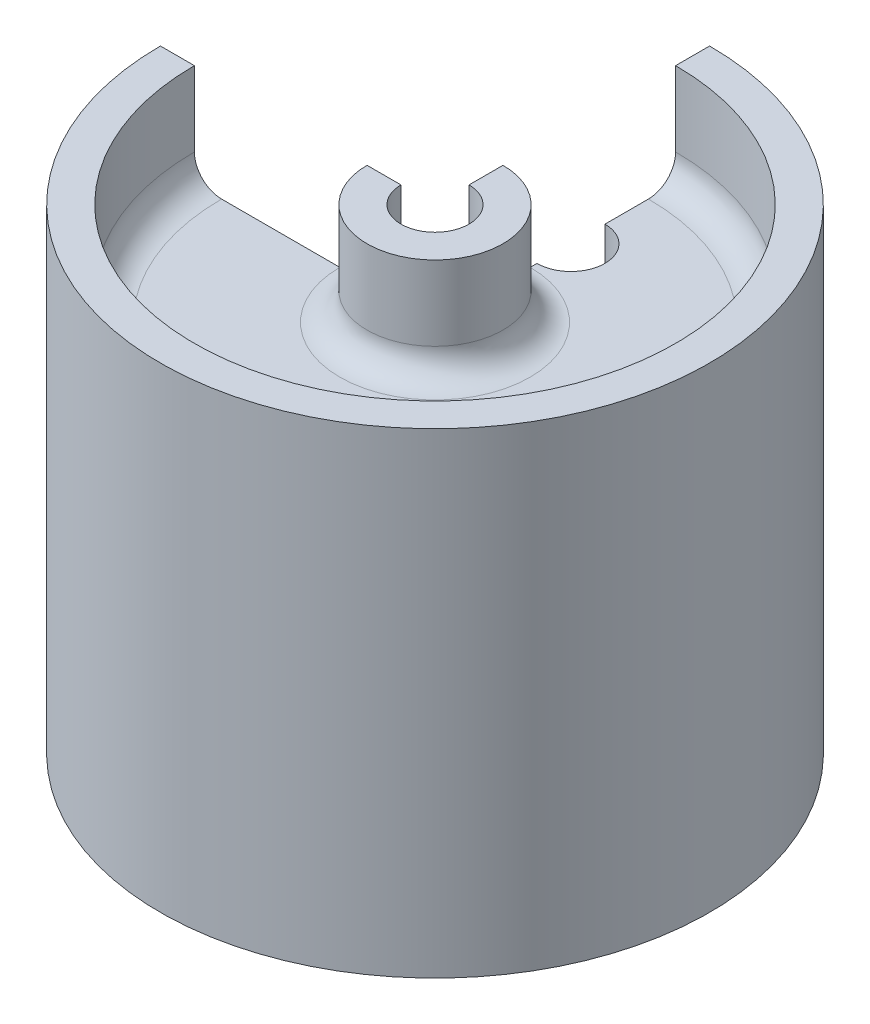
ISO-10303-21;
HEADER;
FILE_DESCRIPTION(('STEP AP214'),'2;1');
FILE_NAME('part.step','',(''),(''),'','','');
FILE_SCHEMA(('AUTOMOTIVE_DESIGN { 1 0 10303 214 1 1 1 1 }'));
ENDSEC;
DATA;
#1=APPLICATION_CONTEXT('core data for automotive mechanical design processes');
#2=APPLICATION_PROTOCOL_DEFINITION('international standard','automotive_design',2000,#1);
#3=PRODUCT_CONTEXT('',#1,'mechanical');
#4=PRODUCT('Part','Part','',(#3));
#5=PRODUCT_RELATED_PRODUCT_CATEGORY('part','',(#4));
#6=PRODUCT_DEFINITION_FORMATION('','',#4);
#7=PRODUCT_DEFINITION_CONTEXT('part definition',#1,'design');
#8=PRODUCT_DEFINITION('design','',#6,#7);
#9=PRODUCT_DEFINITION_SHAPE('','',#8);
#10=(LENGTH_UNIT() NAMED_UNIT(*) SI_UNIT(.MILLI.,.METRE.));
#11=(NAMED_UNIT(*) PLANE_ANGLE_UNIT() SI_UNIT($,.RADIAN.));
#12=(NAMED_UNIT(*) SI_UNIT($,.STERADIAN.) SOLID_ANGLE_UNIT());
#13=UNCERTAINTY_MEASURE_WITH_UNIT(LENGTH_MEASURE(1.E-05),#10,'distance_accuracy_value','');
#14=(GEOMETRIC_REPRESENTATION_CONTEXT(3) GLOBAL_UNCERTAINTY_ASSIGNED_CONTEXT((#13)) GLOBAL_UNIT_ASSIGNED_CONTEXT((#10,
#11,#12)) REPRESENTATION_CONTEXT('',''));
#15=CARTESIAN_POINT('',(0.,0.,0.));
#16=DIRECTION('',(0.,0.,1.));
#17=DIRECTION('',(1.,0.,0.));
#18=AXIS2_PLACEMENT_3D('',#15,#16,#17);
#19=CARTESIAN_POINT('',(0.,0.,0.));
#20=DIRECTION('',(1.,0.,0.));
#21=DIRECTION('',(0.,0.,-1.));
#22=AXIS2_PLACEMENT_3D('',#19,#20,#21);
#23=PLANE('',#22);
#24=DIRECTION('',(0.,-1.,0.));
#25=VECTOR('',#24,1.);
#26=CARTESIAN_POINT('',(0.,45.0234349741081,-9.525));
#27=LINE('',#26,#25);
#28=CARTESIAN_POINT('',(0.,32.3234349741081,-9.525));
#29=VERTEX_POINT('',#28);
#30=CARTESIAN_POINT('',(0.,35.4984349741081,-9.525));
#31=VERTEX_POINT('',#30);
#32=EDGE_CURVE('E175',#29,#31,#27,.F.);
#33=ORIENTED_EDGE('',*,*,#32,.F.);
#34=DIRECTION('',(0.,0.,-1.));
#35=VECTOR('',#34,1.);
#36=CARTESIAN_POINT('',(0.,32.3234349741081,-22.479));
#37=LINE('',#36,#35);
#38=CARTESIAN_POINT('',(0.,32.3234349741081,-8.89));
#39=VERTEX_POINT('',#38);
#40=EDGE_CURVE('E186',#39,#29,#37,.T.);
#41=ORIENTED_EDGE('',*,*,#40,.F.);
#42=CARTESIAN_POINT('',(0.,29.7834349741081,-8.89));
#43=DIRECTION('',(1.,0.,0.));
#44=DIRECTION('',(0.,0.,-1.));
#45=AXIS2_PLACEMENT_3D('',#42,#43,#44);
#46=CIRCLE('',#45,2.54);
#47=CARTESIAN_POINT('',(0.,29.7834349741081,-6.35));
#48=VERTEX_POINT('',#47);
#49=EDGE_CURVE('E314',#39,#48,#46,.T.);
#50=ORIENTED_EDGE('',*,*,#49,.T.);
#51=DIRECTION('',(0.,1.,0.));
#52=VECTOR('',#51,1.);
#53=CARTESIAN_POINT('',(0.,32.3234349741081,-6.35));
#54=LINE('',#53,#52);
#55=CARTESIAN_POINT('',(0.,0.57343497410807,-6.35));
#56=VERTEX_POINT('',#55);
#57=EDGE_CURVE('E194',#56,#48,#54,.T.);
#58=ORIENTED_EDGE('',*,*,#57,.F.);
#59=DIRECTION('',(0.,0.,-1.));
#60=VECTOR('',#59,1.);
#61=CARTESIAN_POINT('',(0.,0.57343497410807,-3.17500000000001));
#62=LINE('',#61,#60);
#63=CARTESIAN_POINT('',(0.,0.57343497410807,-3.17500000000001));
#64=VERTEX_POINT('',#63);
#65=EDGE_CURVE('E200',#64,#56,#62,.T.);
#66=ORIENTED_EDGE('',*,*,#65,.F.);
#67=DIRECTION('',(0.,-1.,0.));
#68=VECTOR('',#67,1.);
#69=CARTESIAN_POINT('',(0.,45.0234349741081,-3.175));
#70=LINE('',#69,#68);
#71=CARTESIAN_POINT('',(0.,45.0234349741081,-3.175));
#72=VERTEX_POINT('',#71);
#73=EDGE_CURVE('E366',#72,#64,#70,.T.);
#74=ORIENTED_EDGE('',*,*,#73,.F.);
#75=DIRECTION('',(0.,0.,1.));
#76=VECTOR('',#75,1.);
#77=CARTESIAN_POINT('',(0.,45.0234349741081,-6.35));
#78=LINE('',#77,#76);
#79=CARTESIAN_POINT('',(0.,45.0234349741081,-6.35));
#80=VERTEX_POINT('',#79);
#81=EDGE_CURVE('E188',#80,#72,#78,.T.);
#82=ORIENTED_EDGE('',*,*,#81,.F.);
#83=DIRECTION('',(0.,1.,0.));
#84=VECTOR('',#83,1.);
#85=CARTESIAN_POINT('',(0.,35.4984349741081,-6.35));
#86=LINE('',#85,#84);
#87=CARTESIAN_POINT('',(0.,38.0384349741081,-6.35));
#88=VERTEX_POINT('',#87);
#89=EDGE_CURVE('E226',#88,#80,#86,.T.);
#90=ORIENTED_EDGE('',*,*,#89,.F.);
#91=CARTESIAN_POINT('',(0.,38.0384349741081,-8.89));
#92=DIRECTION('',(1.,0.,0.));
#93=DIRECTION('',(0.,0.,-1.));
#94=AXIS2_PLACEMENT_3D('',#91,#92,#93);
#95=CIRCLE('',#94,2.54);
#96=CARTESIAN_POINT('',(0.,35.4984349741081,-8.89));
#97=VERTEX_POINT('',#96);
#98=EDGE_CURVE('E47',#88,#97,#95,.T.);
#99=ORIENTED_EDGE('',*,*,#98,.T.);
#100=DIRECTION('',(0.,0.,1.));
#101=VECTOR('',#100,1.);
#102=CARTESIAN_POINT('',(0.,35.4984349741081,-22.479));
#103=LINE('',#102,#101);
#104=EDGE_CURVE('E222',#31,#97,#103,.T.);
#105=ORIENTED_EDGE('',*,*,#104,.F.);
#106=EDGE_LOOP('',(#33,#41,#50,#58,#66,#74,#82,#90,#99,#105));
#107=FACE_BOUND('',#106,.T.);
#108=ADVANCED_FACE('F38',(#107),#23,.F.);
#109=DIRECTION('',(0.,-1.,0.));
#110=VECTOR('',#109,1.);
#111=CARTESIAN_POINT('',(0.,45.0234349741081,-15.875));
#112=LINE('',#111,#110);
#113=CARTESIAN_POINT('',(0.,35.4984349741081,-15.875));
#114=VERTEX_POINT('',#113);
#115=CARTESIAN_POINT('',(0.,32.3234349741081,-15.875));
#116=VERTEX_POINT('',#115);
#117=EDGE_CURVE('E164',#114,#116,#112,.T.);
#118=ORIENTED_EDGE('',*,*,#117,.F.);
#119=CARTESIAN_POINT('',(0.,35.4984349741081,-19.939));
#120=VERTEX_POINT('',#119);
#121=EDGE_CURVE('E223',#120,#114,#103,.T.);
#122=ORIENTED_EDGE('',*,*,#121,.F.);
#123=CARTESIAN_POINT('',(0.,38.0384349741081,-19.939));
#124=DIRECTION('',(1.,0.,0.));
#125=DIRECTION('',(0.,0.,-1.));
#126=AXIS2_PLACEMENT_3D('',#123,#124,#125);
#127=CIRCLE('',#126,2.54);
#128=CARTESIAN_POINT('',(0.,38.0384349741081,-22.479));
#129=VERTEX_POINT('',#128);
#130=EDGE_CURVE('E338',#120,#129,#127,.T.);
#131=ORIENTED_EDGE('',*,*,#130,.T.);
#132=DIRECTION('',(0.,-1.,0.));
#133=VECTOR('',#132,1.);
#134=CARTESIAN_POINT('',(0.,35.4984349741081,-22.479));
#135=LINE('',#134,#133);
#136=CARTESIAN_POINT('',(0.,45.0234349741081,-22.479));
#137=VERTEX_POINT('',#136);
#138=EDGE_CURVE('E218',#137,#129,#135,.T.);
#139=ORIENTED_EDGE('',*,*,#138,.F.);
#140=DIRECTION('',(0.,0.,1.));
#141=VECTOR('',#140,1.);
#142=CARTESIAN_POINT('',(0.,45.0234349741081,-22.479));
#143=LINE('',#142,#141);
#144=CARTESIAN_POINT('',(0.,45.0234349741081,-25.654));
#145=VERTEX_POINT('',#144);
#146=EDGE_CURVE('E214',#145,#137,#143,.T.);
#147=ORIENTED_EDGE('',*,*,#146,.F.);
#148=DIRECTION('',(0.,1.,0.));
#149=VECTOR('',#148,1.);
#150=CARTESIAN_POINT('',(0.,45.0234349741081,-25.654));
#151=LINE('',#150,#149);
#152=CARTESIAN_POINT('',(0.,0.573434974108077,-25.654));
#153=VERTEX_POINT('',#152);
#154=EDGE_CURVE('E210',#153,#145,#151,.T.);
#155=ORIENTED_EDGE('',*,*,#154,.F.);
#156=DIRECTION('',(0.,0.,-1.));
#157=VECTOR('',#156,1.);
#158=CARTESIAN_POINT('',(0.,0.573434974108077,-25.654));
#159=LINE('',#158,#157);
#160=CARTESIAN_POINT('',(0.,0.573434974108077,-22.479));
#161=VERTEX_POINT('',#160);
#162=EDGE_CURVE('E206',#161,#153,#159,.T.);
#163=ORIENTED_EDGE('',*,*,#162,.F.);
#164=DIRECTION('',(0.,-1.,0.));
#165=VECTOR('',#164,1.);
#166=CARTESIAN_POINT('',(0.,0.573434974108077,-22.479));
#167=LINE('',#166,#165);
#168=CARTESIAN_POINT('',(0.,29.7834349741081,-22.479));
#169=VERTEX_POINT('',#168);
#170=EDGE_CURVE('E198',#169,#161,#167,.T.);
#171=ORIENTED_EDGE('',*,*,#170,.F.);
#172=CARTESIAN_POINT('',(0.,29.7834349741081,-19.939));
#173=DIRECTION('',(1.,0.,0.));
#174=DIRECTION('',(0.,0.,-1.));
#175=AXIS2_PLACEMENT_3D('',#172,#173,#174);
#176=CIRCLE('',#175,2.54);
#177=CARTESIAN_POINT('',(0.,32.3234349741081,-19.939));
#178=VERTEX_POINT('',#177);
#179=EDGE_CURVE('E192',#169,#178,#176,.T.);
#180=ORIENTED_EDGE('',*,*,#179,.T.);
#181=EDGE_CURVE('E182',#116,#178,#37,.T.);
#182=ORIENTED_EDGE('',*,*,#181,.F.);
#183=EDGE_LOOP('',(#118,#122,#131,#139,#147,#155,#163,#171,#180,#182));
#184=FACE_BOUND('',#183,.T.);
#185=ADVANCED_FACE('F190',(#184),#23,.F.);
#186=CARTESIAN_POINT('',(-6.35,45.0234349741081,0.));
#187=DIRECTION('',(0.,-1.,0.));
#188=DIRECTION('',(0.,0.,-1.));
#189=AXIS2_PLACEMENT_3D('',#186,#187,#188);
#190=PLANE('',#189);
#191=CARTESIAN_POINT('',(0.,45.0234349741081,0.));
#192=DIRECTION('',(0.,1.,0.));
#193=DIRECTION('',(0.,0.,1.));
#194=AXIS2_PLACEMENT_3D('',#191,#192,#193);
#195=CIRCLE('',#194,3.175);
#196=CARTESIAN_POINT('',(-3.175,45.0234349741081,0.));
#197=VERTEX_POINT('',#196);
#198=EDGE_CURVE('E176',#197,#72,#195,.T.);
#199=ORIENTED_EDGE('',*,*,#198,.F.);
#200=DIRECTION('',(1.,0.,0.));
#201=VECTOR('',#200,1.);
#202=CARTESIAN_POINT('',(-6.35,45.0234349741081,0.));
#203=LINE('',#202,#201);
#204=CARTESIAN_POINT('',(-6.35,45.0234349741081,0.));
#205=VERTEX_POINT('',#204);
#206=EDGE_CURVE('E229',#205,#197,#203,.T.);
#207=ORIENTED_EDGE('',*,*,#206,.F.);
#208=CARTESIAN_POINT('',(0.,45.0234349741081,0.));
#209=DIRECTION('',(0.,1.,0.));
#210=DIRECTION('',(0.,0.,1.));
#211=AXIS2_PLACEMENT_3D('',#208,#209,#210);
#212=CIRCLE('',#211,6.35);
#213=EDGE_CURVE('E274',#205,#80,#212,.T.);
#214=ORIENTED_EDGE('',*,*,#213,.T.);
#215=ORIENTED_EDGE('',*,*,#81,.T.);
#216=EDGE_LOOP('',(#199,#207,#214,#215));
#217=FACE_BOUND('',#216,.T.);
#218=ADVANCED_FACE('F421',(#217),#190,.F.);
#219=CARTESIAN_POINT('',(0.,45.0234349741081,0.));
#220=DIRECTION('',(0.,1.,0.));
#221=DIRECTION('',(0.,0.,1.));
#222=AXIS2_PLACEMENT_3D('',#219,#220,#221);
#223=CYLINDRICAL_SURFACE('',#222,3.175);
#224=CARTESIAN_POINT('',(0.,0.57343497410807,0.));
#225=DIRECTION('',(0.,1.,0.));
#226=DIRECTION('',(0.,0.,1.));
#227=AXIS2_PLACEMENT_3D('',#224,#225,#226);
#228=CIRCLE('',#227,3.17500000000001);
#229=CARTESIAN_POINT('',(-3.17500000000001,0.57343497410807,0.));
#230=VERTEX_POINT('',#229);
#231=EDGE_CURVE('E294',#230,#64,#228,.T.);
#232=ORIENTED_EDGE('',*,*,#231,.F.);
#233=DIRECTION('',(0.,-1.,0.));
#234=VECTOR('',#233,1.);
#235=CARTESIAN_POINT('',(-3.175,45.0234349741081,0.));
#236=LINE('',#235,#234);
#237=EDGE_CURVE('E233',#197,#230,#236,.T.);
#238=ORIENTED_EDGE('',*,*,#237,.F.);
#239=ORIENTED_EDGE('',*,*,#198,.T.);
#240=ORIENTED_EDGE('',*,*,#73,.T.);
#241=EDGE_LOOP('',(#232,#238,#239,#240));
#242=FACE_BOUND('',#241,.T.);
#243=ADVANCED_FACE('F362',(#242),#223,.F.);
#244=CARTESIAN_POINT('',(-3.17500000000001,0.57343497410807,0.));
#245=DIRECTION('',(0.,1.,0.));
#246=DIRECTION('',(0.,0.,1.));
#247=AXIS2_PLACEMENT_3D('',#244,#245,#246);
#248=PLANE('',#247);
#249=CARTESIAN_POINT('',(0.,0.57343497410807,0.));
#250=DIRECTION('',(0.,1.,0.));
#251=DIRECTION('',(0.,0.,1.));
#252=AXIS2_PLACEMENT_3D('',#249,#250,#251);
#253=CIRCLE('',#252,6.35);
#254=CARTESIAN_POINT('',(-6.35,0.57343497410807,0.));
#255=VERTEX_POINT('',#254);
#256=EDGE_CURVE('E291',#255,#56,#253,.T.);
#257=ORIENTED_EDGE('',*,*,#256,.F.);
#258=DIRECTION('',(-1.,0.,0.));
#259=VECTOR('',#258,1.);
#260=CARTESIAN_POINT('',(-3.17500000000001,0.57343497410807,0.));
#261=LINE('',#260,#259);
#262=EDGE_CURVE('E237',#230,#255,#261,.T.);
#263=ORIENTED_EDGE('',*,*,#262,.F.);
#264=ORIENTED_EDGE('',*,*,#231,.T.);
#265=ORIENTED_EDGE('',*,*,#65,.T.);
#266=EDGE_LOOP('',(#257,#263,#264,#265));
#267=FACE_BOUND('',#266,.T.);
#268=ADVANCED_FACE('F370',(#267),#248,.F.);
#269=CARTESIAN_POINT('',(0.,45.0234349741081,0.));
#270=DIRECTION('',(0.,1.,0.));
#271=DIRECTION('',(0.,0.,1.));
#272=AXIS2_PLACEMENT_3D('',#269,#270,#271);
#273=CYLINDRICAL_SURFACE('',#272,6.35);
#274=ORIENTED_EDGE('',*,*,#57,.T.);
#275=CARTESIAN_POINT('',(0.,29.7834349741081,0.));
#276=DIRECTION('',(0.,1.,0.));
#277=DIRECTION('',(0.,0.,1.));
#278=AXIS2_PLACEMENT_3D('',#275,#276,#277);
#279=CIRCLE('',#278,6.35);
#280=CARTESIAN_POINT('',(-6.35,29.7834349741081,0.));
#281=VERTEX_POINT('',#280);
#282=EDGE_CURVE('E307',#48,#281,#279,.F.);
#283=ORIENTED_EDGE('',*,*,#282,.T.);
#284=DIRECTION('',(0.,1.,0.));
#285=VECTOR('',#284,1.);
#286=CARTESIAN_POINT('',(-6.35,32.3234349741081,0.));
#287=LINE('',#286,#285);
#288=EDGE_CURVE('E241',#255,#281,#287,.T.);
#289=ORIENTED_EDGE('',*,*,#288,.F.);
#290=ORIENTED_EDGE('',*,*,#256,.T.);
#291=EDGE_LOOP('',(#274,#283,#289,#290));
#292=FACE_BOUND('',#291,.T.);
#293=ADVANCED_FACE('F375',(#292),#273,.T.);
#294=CARTESIAN_POINT('',(-22.479,32.3234349741081,-2.35455027047564E-13));
#295=DIRECTION('',(0.,1.,0.));
#296=DIRECTION('',(0.,0.,1.));
#297=AXIS2_PLACEMENT_3D('',#294,#295,#296);
#298=PLANE('',#297);
#299=DIRECTION('',(-1.,0.,0.));
#300=VECTOR('',#299,1.);
#301=CARTESIAN_POINT('',(-22.479,32.3234349741081,-2.35455027047564E-13));
#302=LINE('',#301,#300);
#303=CARTESIAN_POINT('',(-8.89,32.3234349741081,0.));
#304=VERTEX_POINT('',#303);
#305=CARTESIAN_POINT('',(-19.939,32.3234349741081,-2.0884993924558E-13));
#306=VERTEX_POINT('',#305);
#307=EDGE_CURVE('E245',#304,#306,#302,.T.);
#308=ORIENTED_EDGE('',*,*,#307,.F.);
#309=CARTESIAN_POINT('',(0.,32.3234349741081,0.));
#310=DIRECTION('',(0.,1.,0.));
#311=DIRECTION('',(0.,0.,1.));
#312=AXIS2_PLACEMENT_3D('',#309,#310,#311);
#313=CIRCLE('',#312,8.89);
#314=EDGE_CURVE('E304',#304,#39,#313,.T.);
#315=ORIENTED_EDGE('',*,*,#314,.T.);
#316=ORIENTED_EDGE('',*,*,#40,.T.);
#317=CARTESIAN_POINT('',(0.,32.3234349741081,-12.7));
#318=DIRECTION('',(0.,1.,0.));
#319=DIRECTION('',(0.,0.,1.));
#320=AXIS2_PLACEMENT_3D('',#317,#318,#319);
#321=CIRCLE('',#320,3.175);
#322=EDGE_CURVE('E167',#116,#29,#321,.F.);
#323=ORIENTED_EDGE('',*,*,#322,.F.);
#324=ORIENTED_EDGE('',*,*,#181,.T.);
#325=CARTESIAN_POINT('',(0.,32.3234349741081,0.));
#326=DIRECTION('',(0.,1.,0.));
#327=DIRECTION('',(0.,0.,1.));
#328=AXIS2_PLACEMENT_3D('',#325,#326,#327);
#329=CIRCLE('',#328,19.939);
#330=EDGE_CURVE('E301',#178,#306,#329,.F.);
#331=ORIENTED_EDGE('',*,*,#330,.T.);
#332=EDGE_LOOP('',(#308,#315,#316,#323,#324,#331));
#333=FACE_BOUND('',#332,.T.);
#334=ADVANCED_FACE('F181',(#333),#298,.F.);
#335=CARTESIAN_POINT('',(0.,45.0234349741081,0.));
#336=DIRECTION('',(0.,1.,0.));
#337=DIRECTION('',(0.,0.,1.));
#338=AXIS2_PLACEMENT_3D('',#335,#336,#337);
#339=CYLINDRICAL_SURFACE('',#338,22.479);
#340=DIRECTION('',(0.,-1.,0.));
#341=VECTOR('',#340,1.);
#342=CARTESIAN_POINT('',(-22.479,0.573434974108077,-2.35455027047564E-13));
#343=LINE('',#342,#341);
#344=CARTESIAN_POINT('',(-22.479,29.7834349741081,-2.35455027047564E-13));
#345=VERTEX_POINT('',#344);
#346=CARTESIAN_POINT('',(-22.479,0.573434974108077,-2.35455027047564E-13));
#347=VERTEX_POINT('',#346);
#348=EDGE_CURVE('E249',#345,#347,#343,.T.);
#349=ORIENTED_EDGE('',*,*,#348,.F.);
#350=CARTESIAN_POINT('',(0.,29.7834349741081,0.));
#351=DIRECTION('',(0.,1.,0.));
#352=DIRECTION('',(0.,0.,1.));
#353=AXIS2_PLACEMENT_3D('',#350,#351,#352);
#354=CIRCLE('',#353,22.479);
#355=EDGE_CURVE('E310',#345,#169,#354,.T.);
#356=ORIENTED_EDGE('',*,*,#355,.T.);
#357=ORIENTED_EDGE('',*,*,#170,.T.);
#358=CARTESIAN_POINT('',(0.,0.573434974108077,0.));
#359=DIRECTION('',(0.,1.,0.));
#360=DIRECTION('',(0.,0.,1.));
#361=AXIS2_PLACEMENT_3D('',#358,#359,#360);
#362=CIRCLE('',#361,22.479);
#363=EDGE_CURVE('E287',#347,#161,#362,.T.);
#364=ORIENTED_EDGE('',*,*,#363,.F.);
#365=EDGE_LOOP('',(#349,#356,#357,#364));
#366=FACE_BOUND('',#365,.T.);
#367=ADVANCED_FACE('F387',(#366),#339,.F.);
#368=CARTESIAN_POINT('',(-25.654,0.573434974108077,-2.68711386800045E-13));
#369=DIRECTION('',(0.,1.,0.));
#370=DIRECTION('',(0.,0.,1.));
#371=AXIS2_PLACEMENT_3D('',#368,#369,#370);
#372=PLANE('',#371);
#373=CARTESIAN_POINT('',(0.,0.573434974108077,0.));
#374=DIRECTION('',(0.,1.,0.));
#375=DIRECTION('',(0.,0.,1.));
#376=AXIS2_PLACEMENT_3D('',#373,#374,#375);
#377=CIRCLE('',#376,25.654);
#378=CARTESIAN_POINT('',(-25.654,0.573434974108077,-2.68711386800045E-13));
#379=VERTEX_POINT('',#378);
#380=EDGE_CURVE('E284',#379,#153,#377,.T.);
#381=ORIENTED_EDGE('',*,*,#380,.F.);
#382=DIRECTION('',(-1.,0.,0.));
#383=VECTOR('',#382,1.);
#384=CARTESIAN_POINT('',(-25.654,0.573434974108077,-2.68711386800045E-13));
#385=LINE('',#384,#383);
#386=EDGE_CURVE('E252',#347,#379,#385,.T.);
#387=ORIENTED_EDGE('',*,*,#386,.F.);
#388=ORIENTED_EDGE('',*,*,#363,.T.);
#389=ORIENTED_EDGE('',*,*,#162,.T.);
#390=EDGE_LOOP('',(#381,#387,#388,#389));
#391=FACE_BOUND('',#390,.T.);
#392=ADVANCED_FACE('F391',(#391),#372,.F.);
#393=CARTESIAN_POINT('',(0.,45.0234349741081,0.));
#394=DIRECTION('',(0.,1.,0.));
#395=DIRECTION('',(0.,0.,1.));
#396=AXIS2_PLACEMENT_3D('',#393,#394,#395);
#397=CYLINDRICAL_SURFACE('',#396,25.654);
#398=CARTESIAN_POINT('',(0.,45.0234349741081,0.));
#399=DIRECTION('',(0.,1.,0.));
#400=DIRECTION('',(0.,0.,1.));
#401=AXIS2_PLACEMENT_3D('',#398,#399,#400);
#402=CIRCLE('',#401,25.654);
#403=CARTESIAN_POINT('',(-25.654,45.0234349741081,-2.68711386800045E-13));
#404=VERTEX_POINT('',#403);
#405=EDGE_CURVE('E281',#404,#145,#402,.T.);
#406=ORIENTED_EDGE('',*,*,#405,.F.);
#407=DIRECTION('',(0.,1.,0.));
#408=VECTOR('',#407,1.);
#409=CARTESIAN_POINT('',(-25.654,45.0234349741081,-2.68711386800045E-13));
#410=LINE('',#409,#408);
#411=EDGE_CURVE('E256',#379,#404,#410,.T.);
#412=ORIENTED_EDGE('',*,*,#411,.F.);
#413=ORIENTED_EDGE('',*,*,#380,.T.);
#414=ORIENTED_EDGE('',*,*,#154,.T.);
#415=EDGE_LOOP('',(#406,#412,#413,#414));
#416=FACE_BOUND('',#415,.T.);
#417=ADVANCED_FACE('F395',(#416),#397,.T.);
#418=CARTESIAN_POINT('',(-22.479,45.0234349741081,-2.35455027047564E-13));
#419=DIRECTION('',(0.,-1.,0.));
#420=DIRECTION('',(0.,0.,-1.));
#421=AXIS2_PLACEMENT_3D('',#418,#419,#420);
#422=PLANE('',#421);
#423=CARTESIAN_POINT('',(0.,45.0234349741081,0.));
#424=DIRECTION('',(0.,1.,0.));
#425=DIRECTION('',(0.,0.,1.));
#426=AXIS2_PLACEMENT_3D('',#423,#424,#425);
#427=CIRCLE('',#426,22.479);
#428=CARTESIAN_POINT('',(-22.479,45.0234349741081,-2.35455027047564E-13));
#429=VERTEX_POINT('',#428);
#430=EDGE_CURVE('E278',#429,#137,#427,.T.);
#431=ORIENTED_EDGE('',*,*,#430,.F.);
#432=DIRECTION('',(1.,0.,0.));
#433=VECTOR('',#432,1.);
#434=CARTESIAN_POINT('',(-22.479,45.0234349741081,-2.35455027047564E-13));
#435=LINE('',#434,#433);
#436=EDGE_CURVE('E260',#404,#429,#435,.T.);
#437=ORIENTED_EDGE('',*,*,#436,.F.);
#438=ORIENTED_EDGE('',*,*,#405,.T.);
#439=ORIENTED_EDGE('',*,*,#146,.T.);
#440=EDGE_LOOP('',(#431,#437,#438,#439));
#441=FACE_BOUND('',#440,.T.);
#442=ADVANCED_FACE('F399',(#441),#422,.F.);
#443=CARTESIAN_POINT('',(0.,45.0234349741081,0.));
#444=DIRECTION('',(0.,1.,0.));
#445=DIRECTION('',(0.,0.,1.));
#446=AXIS2_PLACEMENT_3D('',#443,#444,#445);
#447=CYLINDRICAL_SURFACE('',#446,22.479);
#448=ORIENTED_EDGE('',*,*,#138,.T.);
#449=CARTESIAN_POINT('',(0.,38.0384349741081,0.));
#450=DIRECTION('',(0.,-1.,0.));
#451=DIRECTION('',(0.,0.,-1.));
#452=AXIS2_PLACEMENT_3D('',#449,#450,#451);
#453=CIRCLE('',#452,22.479);
#454=CARTESIAN_POINT('',(-22.479,38.0384349741081,-2.35455027047564E-13));
#455=VERTEX_POINT('',#454);
#456=EDGE_CURVE('E332',#129,#455,#453,.T.);
#457=ORIENTED_EDGE('',*,*,#456,.T.);
#458=DIRECTION('',(0.,-1.,0.));
#459=VECTOR('',#458,1.);
#460=CARTESIAN_POINT('',(-22.479,35.4984349741081,-2.35455027047564E-13));
#461=LINE('',#460,#459);
#462=EDGE_CURVE('E264',#429,#455,#461,.T.);
#463=ORIENTED_EDGE('',*,*,#462,.F.);
#464=ORIENTED_EDGE('',*,*,#430,.T.);
#465=EDGE_LOOP('',(#448,#457,#463,#464));
#466=FACE_BOUND('',#465,.T.);
#467=ADVANCED_FACE('F404',(#466),#447,.F.);
#468=CARTESIAN_POINT('',(-22.479,35.4984349741081,-2.35455027047564E-13));
#469=DIRECTION('',(0.,-1.,0.));
#470=DIRECTION('',(0.,0.,-1.));
#471=AXIS2_PLACEMENT_3D('',#468,#469,#470);
#472=PLANE('',#471);
#473=DIRECTION('',(1.,0.,0.));
#474=VECTOR('',#473,1.);
#475=CARTESIAN_POINT('',(-22.479,35.4984349741081,-2.35455027047564E-13));
#476=LINE('',#475,#474);
#477=CARTESIAN_POINT('',(-19.939,35.4984349741081,-2.0884993924558E-13));
#478=VERTEX_POINT('',#477);
#479=CARTESIAN_POINT('',(-8.89,35.4984349741081,0.));
#480=VERTEX_POINT('',#479);
#481=EDGE_CURVE('E268',#478,#480,#476,.T.);
#482=ORIENTED_EDGE('',*,*,#481,.F.);
#483=CARTESIAN_POINT('',(0.,35.4984349741081,0.));
#484=DIRECTION('',(0.,-1.,0.));
#485=DIRECTION('',(0.,0.,-1.));
#486=AXIS2_PLACEMENT_3D('',#483,#484,#485);
#487=CIRCLE('',#486,19.939);
#488=EDGE_CURVE('E328',#478,#120,#487,.F.);
#489=ORIENTED_EDGE('',*,*,#488,.T.);
#490=ORIENTED_EDGE('',*,*,#121,.T.);
#491=CARTESIAN_POINT('',(0.,35.4984349741081,-12.7));
#492=DIRECTION('',(0.,-1.,0.));
#493=DIRECTION('',(0.,0.,-1.));
#494=AXIS2_PLACEMENT_3D('',#491,#492,#493);
#495=CIRCLE('',#494,3.175);
#496=EDGE_CURVE('E170',#31,#114,#495,.F.);
#497=ORIENTED_EDGE('',*,*,#496,.F.);
#498=ORIENTED_EDGE('',*,*,#104,.T.);
#499=CARTESIAN_POINT('',(0.,35.4984349741081,0.));
#500=DIRECTION('',(0.,-1.,0.));
#501=DIRECTION('',(0.,0.,-1.));
#502=AXIS2_PLACEMENT_3D('',#499,#500,#501);
#503=CIRCLE('',#502,8.89);
#504=EDGE_CURVE('E325',#97,#480,#503,.T.);
#505=ORIENTED_EDGE('',*,*,#504,.T.);
#506=EDGE_LOOP('',(#482,#489,#490,#497,#498,#505));
#507=FACE_BOUND('',#506,.T.);
#508=ADVANCED_FACE('F351',(#507),#472,.F.);
#509=CARTESIAN_POINT('',(0.,45.0234349741081,0.));
#510=DIRECTION('',(0.,1.,0.));
#511=DIRECTION('',(0.,0.,1.));
#512=AXIS2_PLACEMENT_3D('',#509,#510,#511);
#513=CYLINDRICAL_SURFACE('',#512,6.35);
#514=DIRECTION('',(0.,1.,0.));
#515=VECTOR('',#514,1.);
#516=CARTESIAN_POINT('',(-6.35,35.4984349741081,0.));
#517=LINE('',#516,#515);
#518=CARTESIAN_POINT('',(-6.35,38.0384349741081,0.));
#519=VERTEX_POINT('',#518);
#520=EDGE_CURVE('E271',#519,#205,#517,.T.);
#521=ORIENTED_EDGE('',*,*,#520,.F.);
#522=CARTESIAN_POINT('',(0.,38.0384349741081,0.));
#523=DIRECTION('',(0.,-1.,0.));
#524=DIRECTION('',(0.,0.,-1.));
#525=AXIS2_PLACEMENT_3D('',#522,#523,#524);
#526=CIRCLE('',#525,6.35);
#527=EDGE_CURVE('E335',#519,#88,#526,.F.);
#528=ORIENTED_EDGE('',*,*,#527,.T.);
#529=ORIENTED_EDGE('',*,*,#89,.T.);
#530=ORIENTED_EDGE('',*,*,#213,.F.);
#531=EDGE_LOOP('',(#521,#528,#529,#530));
#532=FACE_BOUND('',#531,.T.);
#533=ADVANCED_FACE('F354',(#532),#513,.T.);
#534=CARTESIAN_POINT('',(0.,0.,0.));
#535=DIRECTION('',(0.,0.,-1.));
#536=DIRECTION('',(-1.,0.,0.));
#537=AXIS2_PLACEMENT_3D('',#534,#535,#536);
#538=PLANE('',#537);
#539=ORIENTED_EDGE('',*,*,#206,.T.);
#540=ORIENTED_EDGE('',*,*,#237,.T.);
#541=ORIENTED_EDGE('',*,*,#262,.T.);
#542=ORIENTED_EDGE('',*,*,#288,.T.);
#543=CARTESIAN_POINT('',(-8.89,29.7834349741081,0.));
#544=DIRECTION('',(0.,0.,-1.));
#545=DIRECTION('',(-1.,0.,0.));
#546=AXIS2_PLACEMENT_3D('',#543,#544,#545);
#547=CIRCLE('',#546,2.54);
#548=EDGE_CURVE('E317',#281,#304,#547,.F.);
#549=ORIENTED_EDGE('',*,*,#548,.T.);
#550=ORIENTED_EDGE('',*,*,#307,.T.);
#551=CARTESIAN_POINT('',(-19.939,29.7834349741081,-2.0884993924558E-13));
#552=DIRECTION('',(0.,0.,-1.));
#553=DIRECTION('',(-1.,0.,0.));
#554=AXIS2_PLACEMENT_3D('',#551,#552,#553);
#555=CIRCLE('',#554,2.54);
#556=EDGE_CURVE('E322',#306,#345,#555,.F.);
#557=ORIENTED_EDGE('',*,*,#556,.T.);
#558=ORIENTED_EDGE('',*,*,#348,.T.);
#559=ORIENTED_EDGE('',*,*,#386,.T.);
#560=ORIENTED_EDGE('',*,*,#411,.T.);
#561=ORIENTED_EDGE('',*,*,#436,.T.);
#562=ORIENTED_EDGE('',*,*,#462,.T.);
#563=CARTESIAN_POINT('',(-19.939,38.0384349741081,-2.0884993924558E-13));
#564=DIRECTION('',(0.,0.,-1.));
#565=DIRECTION('',(-1.,0.,0.));
#566=AXIS2_PLACEMENT_3D('',#563,#564,#565);
#567=CIRCLE('',#566,2.54);
#568=EDGE_CURVE('E341',#455,#478,#567,.F.);
#569=ORIENTED_EDGE('',*,*,#568,.T.);
#570=ORIENTED_EDGE('',*,*,#481,.T.);
#571=CARTESIAN_POINT('',(-8.89,38.0384349741081,0.));
#572=DIRECTION('',(0.,0.,-1.));
#573=DIRECTION('',(-1.,0.,0.));
#574=AXIS2_PLACEMENT_3D('',#571,#572,#573);
#575=CIRCLE('',#574,2.54);
#576=EDGE_CURVE('E11',#480,#519,#575,.F.);
#577=ORIENTED_EDGE('',*,*,#576,.T.);
#578=ORIENTED_EDGE('',*,*,#520,.T.);
#579=EDGE_LOOP('',(#539,#540,#541,#542,#549,#550,#557,#558,#559,#560,#561,#562,#569,#570,#577,#578));
#580=FACE_BOUND('',#579,.T.);
#581=ADVANCED_FACE('F357',(#580),#538,.T.);
#582=CARTESIAN_POINT('',(0.,45.0234349741081,-12.7));
#583=DIRECTION('',(0.,-1.,0.));
#584=DIRECTION('',(0.,0.,-1.));
#585=AXIS2_PLACEMENT_3D('',#582,#583,#584);
#586=CYLINDRICAL_SURFACE('',#585,3.175);
#587=ORIENTED_EDGE('',*,*,#32,.T.);
#588=ORIENTED_EDGE('',*,*,#496,.T.);
#589=ORIENTED_EDGE('',*,*,#117,.T.);
#590=ORIENTED_EDGE('',*,*,#322,.T.);
#591=EDGE_LOOP('',(#587,#588,#589,#590));
#592=FACE_BOUND('',#591,.T.);
#593=ADVANCED_FACE('F166',(#592),#586,.F.);
#594=CARTESIAN_POINT('',(0.,29.7834349741081,0.));
#595=DIRECTION('',(0.,1.,0.));
#596=DIRECTION('',(0.,0.,1.));
#597=AXIS2_PLACEMENT_3D('',#594,#595,#596);
#598=TOROIDAL_SURFACE('',#597,8.89,2.54);
#599=ORIENTED_EDGE('',*,*,#548,.F.);
#600=ORIENTED_EDGE('',*,*,#282,.F.);
#601=ORIENTED_EDGE('',*,*,#49,.F.);
#602=ORIENTED_EDGE('',*,*,#314,.F.);
#603=EDGE_LOOP('',(#599,#600,#601,#602));
#604=FACE_BOUND('',#603,.T.);
#605=ADVANCED_FACE('F378',(#604),#598,.F.);
#606=CARTESIAN_POINT('',(0.,29.7834349741081,0.));
#607=DIRECTION('',(0.,1.,0.));
#608=DIRECTION('',(0.,0.,1.));
#609=AXIS2_PLACEMENT_3D('',#606,#607,#608);
#610=TOROIDAL_SURFACE('',#609,19.939,2.54);
#611=ORIENTED_EDGE('',*,*,#556,.F.);
#612=ORIENTED_EDGE('',*,*,#330,.F.);
#613=ORIENTED_EDGE('',*,*,#179,.F.);
#614=ORIENTED_EDGE('',*,*,#355,.F.);
#615=EDGE_LOOP('',(#611,#612,#613,#614));
#616=FACE_BOUND('',#615,.T.);
#617=ADVANCED_FACE('F382',(#616),#610,.F.);
#618=CARTESIAN_POINT('',(0.,38.0384349741081,0.));
#619=DIRECTION('',(0.,-1.,0.));
#620=DIRECTION('',(0.,0.,-1.));
#621=AXIS2_PLACEMENT_3D('',#618,#619,#620);
#622=TOROIDAL_SURFACE('',#621,19.939,2.54);
#623=ORIENTED_EDGE('',*,*,#568,.F.);
#624=ORIENTED_EDGE('',*,*,#456,.F.);
#625=ORIENTED_EDGE('',*,*,#130,.F.);
#626=ORIENTED_EDGE('',*,*,#488,.F.);
#627=EDGE_LOOP('',(#623,#624,#625,#626));
#628=FACE_BOUND('',#627,.T.);
#629=ADVANCED_FACE('F407',(#628),#622,.F.);
#630=CARTESIAN_POINT('',(0.,38.0384349741081,0.));
#631=DIRECTION('',(0.,-1.,0.));
#632=DIRECTION('',(0.,0.,-1.));
#633=AXIS2_PLACEMENT_3D('',#630,#631,#632);
#634=TOROIDAL_SURFACE('',#633,8.89,2.54);
#635=ORIENTED_EDGE('',*,*,#576,.F.);
#636=ORIENTED_EDGE('',*,*,#504,.F.);
#637=ORIENTED_EDGE('',*,*,#98,.F.);
#638=ORIENTED_EDGE('',*,*,#527,.F.);
#639=EDGE_LOOP('',(#635,#636,#637,#638));
#640=FACE_BOUND('',#639,.T.);
#641=ADVANCED_FACE('F40',(#640),#634,.F.);
#642=CLOSED_SHELL('',(#108,#185,#218,#243,#268,#293,#334,#367,#392,#417,#442,#467,#508,#533,
#581,#593,#605,#617,#629,#641));
#643=MANIFOLD_SOLID_BREP('B2',#642);
#644=ADVANCED_BREP_SHAPE_REPRESENTATION('',(#18,#643),#14);
#645=SHAPE_DEFINITION_REPRESENTATION(#9,#644);
ENDSEC;
END-ISO-10303-21;
